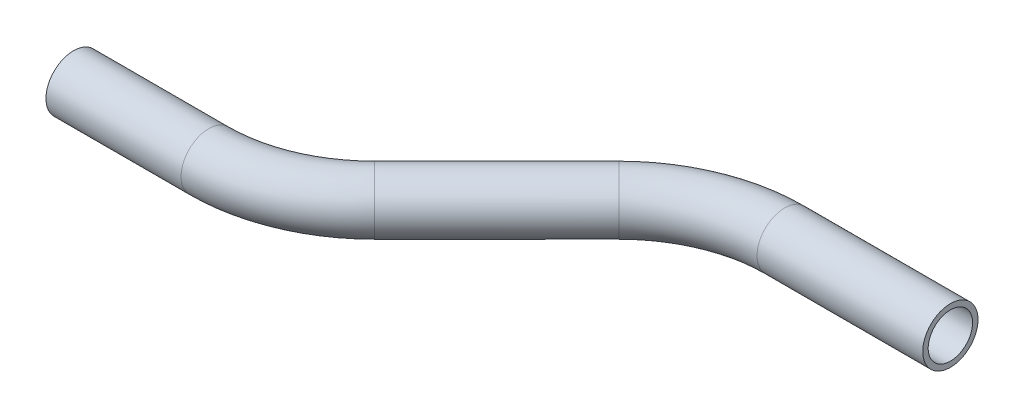
ISO-10303-21;
HEADER;
FILE_DESCRIPTION(('STEP AP214'),'2;1');
FILE_NAME('part.step','',(''),(''),'','','');
FILE_SCHEMA(('AUTOMOTIVE_DESIGN { 1 0 10303 214 1 1 1 1 }'));
ENDSEC;
DATA;
#1=APPLICATION_CONTEXT('core data for automotive mechanical design processes');
#2=APPLICATION_PROTOCOL_DEFINITION('international standard','automotive_design',2000,#1);
#3=PRODUCT_CONTEXT('',#1,'mechanical');
#4=PRODUCT('Part','Part','',(#3));
#5=PRODUCT_RELATED_PRODUCT_CATEGORY('part','',(#4));
#6=PRODUCT_DEFINITION_FORMATION('','',#4);
#7=PRODUCT_DEFINITION_CONTEXT('part definition',#1,'design');
#8=PRODUCT_DEFINITION('design','',#6,#7);
#9=PRODUCT_DEFINITION_SHAPE('','',#8);
#10=(LENGTH_UNIT() NAMED_UNIT(*) SI_UNIT(.MILLI.,.METRE.));
#11=(NAMED_UNIT(*) PLANE_ANGLE_UNIT() SI_UNIT($,.RADIAN.));
#12=(NAMED_UNIT(*) SI_UNIT($,.STERADIAN.) SOLID_ANGLE_UNIT());
#13=UNCERTAINTY_MEASURE_WITH_UNIT(LENGTH_MEASURE(1.E-05),#10,'distance_accuracy_value','');
#14=(GEOMETRIC_REPRESENTATION_CONTEXT(3) GLOBAL_UNCERTAINTY_ASSIGNED_CONTEXT((#13)) GLOBAL_UNIT_ASSIGNED_CONTEXT((#10,
#11,#12)) REPRESENTATION_CONTEXT('',''));
#15=CARTESIAN_POINT('',(0.,0.,0.));
#16=DIRECTION('',(0.,0.,1.));
#17=DIRECTION('',(1.,0.,0.));
#18=AXIS2_PLACEMENT_3D('',#15,#16,#17);
#19=CARTESIAN_POINT('',(0.,0.,0.));
#20=DIRECTION('',(1.,0.,0.));
#21=DIRECTION('',(0.,0.,-1.));
#22=AXIS2_PLACEMENT_3D('',#19,#20,#21);
#23=CYLINDRICAL_SURFACE('',#22,6.35);
#24=CARTESIAN_POINT('',(31.0663525143776,0.,0.));
#25=DIRECTION('',(1.,0.,0.));
#26=DIRECTION('',(0.,0.,-1.));
#27=AXIS2_PLACEMENT_3D('',#24,#25,#26);
#28=CIRCLE('',#27,6.35);
#29=CARTESIAN_POINT('',(31.0663525143776,0.,6.34999999999999));
#30=VERTEX_POINT('',#29);
#31=EDGE_CURVE('E60',#30,#30,#28,.T.);
#32=ORIENTED_EDGE('',*,*,#31,.F.);
#33=EDGE_LOOP('',(#32));
#34=FACE_BOUND('',#33,.T.);
#35=CARTESIAN_POINT('',(0.,0.,0.));
#36=DIRECTION('',(1.,0.,0.));
#37=DIRECTION('',(0.,0.,-1.));
#38=AXIS2_PLACEMENT_3D('',#35,#36,#37);
#39=CIRCLE('',#38,6.35);
#40=CARTESIAN_POINT('',(0.,0.,-6.35));
#41=VERTEX_POINT('',#40);
#42=EDGE_CURVE('E57',#41,#41,#39,.T.);
#43=ORIENTED_EDGE('',*,*,#42,.T.);
#44=EDGE_LOOP('',(#43));
#45=FACE_BOUND('',#44,.T.);
#46=ADVANCED_FACE('F36',(#34,#45),#23,.T.);
#47=CARTESIAN_POINT('',(31.0663525143776,0.,-38.1));
#48=DIRECTION('',(0.,1.,0.));
#49=DIRECTION('',(0.,0.,1.));
#50=AXIS2_PLACEMENT_3D('',#47,#48,#49);
#51=TOROIDAL_SURFACE('',#50,38.1,6.35);
#52=CARTESIAN_POINT('',(58.0071208775851,0.,-11.1592316367926));
#53=DIRECTION('',(0.707106781186546,0.,-0.707106781186549));
#54=DIRECTION('',(-0.707106781186549,0.,-0.707106781186546));
#55=AXIS2_PLACEMENT_3D('',#52,#53,#54);
#56=CIRCLE('',#55,6.35);
#57=CARTESIAN_POINT('',(62.4972489381197,0.,-6.66910357625802));
#58=VERTEX_POINT('',#57);
#59=EDGE_CURVE('E63',#58,#58,#56,.T.);
#60=CARTESIAN_POINT('',(31.0663525143776,0.,-38.1));
#61=DIRECTION('',(0.,1.,0.));
#62=DIRECTION('',(0.,0.,1.));
#63=AXIS2_PLACEMENT_3D('',#60,#61,#62);
#64=CIRCLE('',#63,44.45);
#65=EDGE_CURVE('',#30,#58,#64,.T.);
#66=ORIENTED_EDGE('',*,*,#31,.T.);
#67=ORIENTED_EDGE('',*,*,#59,.F.);
#68=ORIENTED_EDGE('',*,*,#65,.T.);
#69=ORIENTED_EDGE('',*,*,#65,.F.);
#70=EDGE_LOOP('',(#66,#68,#67,#69));
#71=FACE_BOUND('',#70,.T.);
#72=ADVANCED_FACE('F82',(#71),#51,.T.);
#73=CARTESIAN_POINT('',(58.0071208775851,0.,-11.1592316367926));
#74=DIRECTION('',(0.707106781186546,0.,-0.707106781186549));
#75=DIRECTION('',(-0.707106781186549,0.,-0.707106781186546));
#76=AXIS2_PLACEMENT_3D('',#73,#74,#75);
#77=CYLINDRICAL_SURFACE('',#76,6.35);
#78=CARTESIAN_POINT('',(86.1047874039998,0.,-39.2568981632074));
#79=DIRECTION('',(0.707106781186546,0.,-0.707106781186549));
#80=DIRECTION('',(-0.707106781186549,0.,-0.707106781186546));
#81=AXIS2_PLACEMENT_3D('',#78,#79,#80);
#82=CIRCLE('',#81,6.35);
#83=CARTESIAN_POINT('',(81.6146593434652,0.,-43.747026223742));
#84=VERTEX_POINT('',#83);
#85=EDGE_CURVE('E65',#84,#84,#82,.T.);
#86=ORIENTED_EDGE('',*,*,#85,.F.);
#87=EDGE_LOOP('',(#86));
#88=FACE_BOUND('',#87,.T.);
#89=ORIENTED_EDGE('',*,*,#59,.T.);
#90=EDGE_LOOP('',(#89));
#91=FACE_BOUND('',#90,.T.);
#92=ADVANCED_FACE('F75',(#88,#91),#77,.T.);
#93=CARTESIAN_POINT('',(113.045555767207,0.,-12.3161298));
#94=DIRECTION('',(0.,-1.,0.));
#95=DIRECTION('',(0.,0.,-1.));
#96=AXIS2_PLACEMENT_3D('',#93,#94,#95);
#97=TOROIDAL_SURFACE('',#96,38.1,6.35);
#98=CARTESIAN_POINT('',(113.045555767207,0.,-50.4161298));
#99=DIRECTION('',(1.,0.,0.));
#100=DIRECTION('',(0.,0.,-1.));
#101=AXIS2_PLACEMENT_3D('',#98,#99,#100);
#102=CIRCLE('',#101,6.35);
#103=CARTESIAN_POINT('',(113.045555767207,0.,-56.7661298));
#104=VERTEX_POINT('',#103);
#105=EDGE_CURVE('E40',#104,#104,#102,.T.);
#106=CARTESIAN_POINT('',(113.045555767207,0.,-12.3161298));
#107=DIRECTION('',(0.,-1.,0.));
#108=DIRECTION('',(0.,0.,-1.));
#109=AXIS2_PLACEMENT_3D('',#106,#107,#108);
#110=CIRCLE('',#109,44.45);
#111=EDGE_CURVE('',#84,#104,#110,.T.);
#112=ORIENTED_EDGE('',*,*,#85,.T.);
#113=ORIENTED_EDGE('',*,*,#105,.F.);
#114=ORIENTED_EDGE('',*,*,#111,.T.);
#115=ORIENTED_EDGE('',*,*,#111,.F.);
#116=EDGE_LOOP('',(#112,#114,#113,#115));
#117=FACE_BOUND('',#116,.T.);
#118=ADVANCED_FACE('F73',(#117),#97,.T.);
#119=CARTESIAN_POINT('',(113.045555767207,0.,-50.4161298));
#120=DIRECTION('',(1.,0.,0.));
#121=DIRECTION('',(0.,0.,-1.));
#122=AXIS2_PLACEMENT_3D('',#119,#120,#121);
#123=CYLINDRICAL_SURFACE('',#122,6.35);
#124=CARTESIAN_POINT('',(151.145555767207,0.,-50.4161298));
#125=DIRECTION('',(1.,0.,0.));
#126=DIRECTION('',(0.,0.,-1.));
#127=AXIS2_PLACEMENT_3D('',#124,#125,#126);
#128=CIRCLE('',#127,6.35);
#129=CARTESIAN_POINT('',(151.145555767207,0.,-56.7661298));
#130=VERTEX_POINT('',#129);
#131=EDGE_CURVE('E53',#130,#130,#128,.T.);
#132=ORIENTED_EDGE('',*,*,#131,.F.);
#133=EDGE_LOOP('',(#132));
#134=FACE_BOUND('',#133,.T.);
#135=ORIENTED_EDGE('',*,*,#105,.T.);
#136=EDGE_LOOP('',(#135));
#137=FACE_BOUND('',#136,.T.);
#138=ADVANCED_FACE('F38',(#134,#137),#123,.T.);
#139=CARTESIAN_POINT('',(0.,0.,0.));
#140=DIRECTION('',(1.,0.,0.));
#141=DIRECTION('',(0.,0.,-1.));
#142=AXIS2_PLACEMENT_3D('',#139,#140,#141);
#143=PLANE('',#142);
#144=CARTESIAN_POINT('',(0.,0.,0.));
#145=DIRECTION('',(1.,0.,0.));
#146=DIRECTION('',(0.,0.,-1.));
#147=AXIS2_PLACEMENT_3D('',#144,#145,#146);
#148=CIRCLE('',#147,5.1054);
#149=CARTESIAN_POINT('',(0.,0.,-5.1054));
#150=VERTEX_POINT('',#149);
#151=EDGE_CURVE('E56',#150,#150,#148,.F.);
#152=ORIENTED_EDGE('',*,*,#151,.F.);
#153=EDGE_LOOP('',(#152));
#154=FACE_BOUND('',#153,.T.);
#155=ORIENTED_EDGE('',*,*,#42,.F.);
#156=EDGE_LOOP('',(#155));
#157=FACE_BOUND('',#156,.T.);
#158=ADVANCED_FACE('F80',(#154,#157),#143,.F.);
#159=CARTESIAN_POINT('',(151.145555767207,0.,-50.4161298));
#160=DIRECTION('',(1.,0.,0.));
#161=DIRECTION('',(0.,0.,-1.));
#162=AXIS2_PLACEMENT_3D('',#159,#160,#161);
#163=PLANE('',#162);
#164=CARTESIAN_POINT('',(151.145555767207,0.,-50.4161298));
#165=DIRECTION('',(1.,0.,0.));
#166=DIRECTION('',(0.,0.,-1.));
#167=AXIS2_PLACEMENT_3D('',#164,#165,#166);
#168=CIRCLE('',#167,5.1054);
#169=CARTESIAN_POINT('',(151.145555767207,0.,-55.5215298));
#170=VERTEX_POINT('',#169);
#171=EDGE_CURVE('E10',#170,#170,#168,.F.);
#172=ORIENTED_EDGE('',*,*,#171,.T.);
#173=EDGE_LOOP('',(#172));
#174=FACE_BOUND('',#173,.T.);
#175=ORIENTED_EDGE('',*,*,#131,.T.);
#176=EDGE_LOOP('',(#175));
#177=FACE_BOUND('',#176,.T.);
#178=ADVANCED_FACE('F99',(#174,#177),#163,.T.);
#179=CARTESIAN_POINT('',(0.,0.,0.));
#180=DIRECTION('',(1.,0.,0.));
#181=DIRECTION('',(0.,0.,-1.));
#182=AXIS2_PLACEMENT_3D('',#179,#180,#181);
#183=CYLINDRICAL_SURFACE('',#182,5.1054);
#184=CARTESIAN_POINT('',(31.0663525143776,0.,0.));
#185=DIRECTION('',(1.,0.,0.));
#186=DIRECTION('',(0.,0.,-1.));
#187=AXIS2_PLACEMENT_3D('',#184,#185,#186);
#188=CIRCLE('',#187,5.1054);
#189=CARTESIAN_POINT('',(31.0663525143776,0.,5.10539999999999));
#190=VERTEX_POINT('',#189);
#191=EDGE_CURVE('E196',#190,#190,#188,.F.);
#192=ORIENTED_EDGE('',*,*,#191,.F.);
#193=EDGE_LOOP('',(#192));
#194=FACE_BOUND('',#193,.T.);
#195=ORIENTED_EDGE('',*,*,#151,.T.);
#196=EDGE_LOOP('',(#195));
#197=FACE_BOUND('',#196,.T.);
#198=ADVANCED_FACE('F102',(#194,#197),#183,.F.);
#199=CARTESIAN_POINT('',(31.0663525143776,0.,-38.1));
#200=DIRECTION('',(0.,1.,0.));
#201=DIRECTION('',(0.,0.,1.));
#202=AXIS2_PLACEMENT_3D('',#199,#200,#201);
#203=TOROIDAL_SURFACE('',#202,38.1,5.1054);
#204=CARTESIAN_POINT('',(58.0071208775851,0.,-11.1592316367926));
#205=DIRECTION('',(0.707106781186546,0.,-0.707106781186549));
#206=DIRECTION('',(-0.707106781186549,0.,-0.707106781186546));
#207=AXIS2_PLACEMENT_3D('',#204,#205,#206);
#208=CIRCLE('',#207,5.1054);
#209=CARTESIAN_POINT('',(61.6171838382549,0.,-7.5491686761228));
#210=VERTEX_POINT('',#209);
#211=EDGE_CURVE('E195',#210,#210,#208,.F.);
#212=CARTESIAN_POINT('',(31.0663525143776,0.,-38.1));
#213=DIRECTION('',(0.,1.,0.));
#214=DIRECTION('',(0.,0.,1.));
#215=AXIS2_PLACEMENT_3D('',#212,#213,#214);
#216=CIRCLE('',#215,43.2054);
#217=EDGE_CURVE('',#190,#210,#216,.T.);
#218=ORIENTED_EDGE('',*,*,#191,.T.);
#219=ORIENTED_EDGE('',*,*,#211,.F.);
#220=ORIENTED_EDGE('',*,*,#217,.T.);
#221=ORIENTED_EDGE('',*,*,#217,.F.);
#222=EDGE_LOOP('',(#218,#220,#219,#221));
#223=FACE_BOUND('',#222,.T.);
#224=ADVANCED_FACE('F158',(#223),#203,.F.);
#225=CARTESIAN_POINT('',(58.0071208775851,0.,-11.1592316367926));
#226=DIRECTION('',(0.707106781186546,0.,-0.707106781186549));
#227=DIRECTION('',(-0.707106781186549,0.,-0.707106781186546));
#228=AXIS2_PLACEMENT_3D('',#225,#226,#227);
#229=CYLINDRICAL_SURFACE('',#228,5.1054);
#230=CARTESIAN_POINT('',(86.1047874039998,0.,-39.2568981632074));
#231=DIRECTION('',(0.707106781186546,0.,-0.707106781186549));
#232=DIRECTION('',(-0.707106781186549,0.,-0.707106781186546));
#233=AXIS2_PLACEMENT_3D('',#230,#231,#232);
#234=CIRCLE('',#233,5.1054);
#235=CARTESIAN_POINT('',(82.49472444333,0.,-42.8669611238772));
#236=VERTEX_POINT('',#235);
#237=EDGE_CURVE('E49',#236,#236,#234,.F.);
#238=ORIENTED_EDGE('',*,*,#237,.F.);
#239=EDGE_LOOP('',(#238));
#240=FACE_BOUND('',#239,.T.);
#241=ORIENTED_EDGE('',*,*,#211,.T.);
#242=EDGE_LOOP('',(#241));
#243=FACE_BOUND('',#242,.T.);
#244=ADVANCED_FACE('F93',(#240,#243),#229,.F.);
#245=CARTESIAN_POINT('',(113.045555767207,0.,-12.3161298));
#246=DIRECTION('',(0.,-1.,0.));
#247=DIRECTION('',(0.,0.,-1.));
#248=AXIS2_PLACEMENT_3D('',#245,#246,#247);
#249=TOROIDAL_SURFACE('',#248,38.1,5.1054);
#250=CARTESIAN_POINT('',(113.045555767207,0.,-50.4161298));
#251=DIRECTION('',(1.,0.,0.));
#252=DIRECTION('',(0.,0.,-1.));
#253=AXIS2_PLACEMENT_3D('',#250,#251,#252);
#254=CIRCLE('',#253,5.1054);
#255=CARTESIAN_POINT('',(113.045555767207,0.,-55.5215298));
#256=VERTEX_POINT('',#255);
#257=EDGE_CURVE('E44',#256,#256,#254,.F.);
#258=CARTESIAN_POINT('',(113.045555767207,0.,-12.3161298));
#259=DIRECTION('',(0.,-1.,0.));
#260=DIRECTION('',(0.,0.,-1.));
#261=AXIS2_PLACEMENT_3D('',#258,#259,#260);
#262=CIRCLE('',#261,43.2054);
#263=EDGE_CURVE('',#236,#256,#262,.T.);
#264=ORIENTED_EDGE('',*,*,#237,.T.);
#265=ORIENTED_EDGE('',*,*,#257,.F.);
#266=ORIENTED_EDGE('',*,*,#263,.T.);
#267=ORIENTED_EDGE('',*,*,#263,.F.);
#268=EDGE_LOOP('',(#264,#266,#265,#267));
#269=FACE_BOUND('',#268,.T.);
#270=ADVANCED_FACE('F87',(#269),#249,.F.);
#271=CARTESIAN_POINT('',(113.045555767207,0.,-50.4161298));
#272=DIRECTION('',(1.,0.,0.));
#273=DIRECTION('',(0.,0.,-1.));
#274=AXIS2_PLACEMENT_3D('',#271,#272,#273);
#275=CYLINDRICAL_SURFACE('',#274,5.1054);
#276=ORIENTED_EDGE('',*,*,#171,.F.);
#277=EDGE_LOOP('',(#276));
#278=FACE_BOUND('',#277,.T.);
#279=ORIENTED_EDGE('',*,*,#257,.T.);
#280=EDGE_LOOP('',(#279));
#281=FACE_BOUND('',#280,.T.);
#282=ADVANCED_FACE('F85',(#278,#281),#275,.F.);
#283=CLOSED_SHELL('',(#46,#72,#92,#118,#138,#158,#178,#198,#224,#244,#270,#282));
#284=MANIFOLD_SOLID_BREP('B2',#283);
#285=ADVANCED_BREP_SHAPE_REPRESENTATION('',(#18,#284),#14);
#286=SHAPE_DEFINITION_REPRESENTATION(#9,#285);
ENDSEC;
END-ISO-10303-21;
